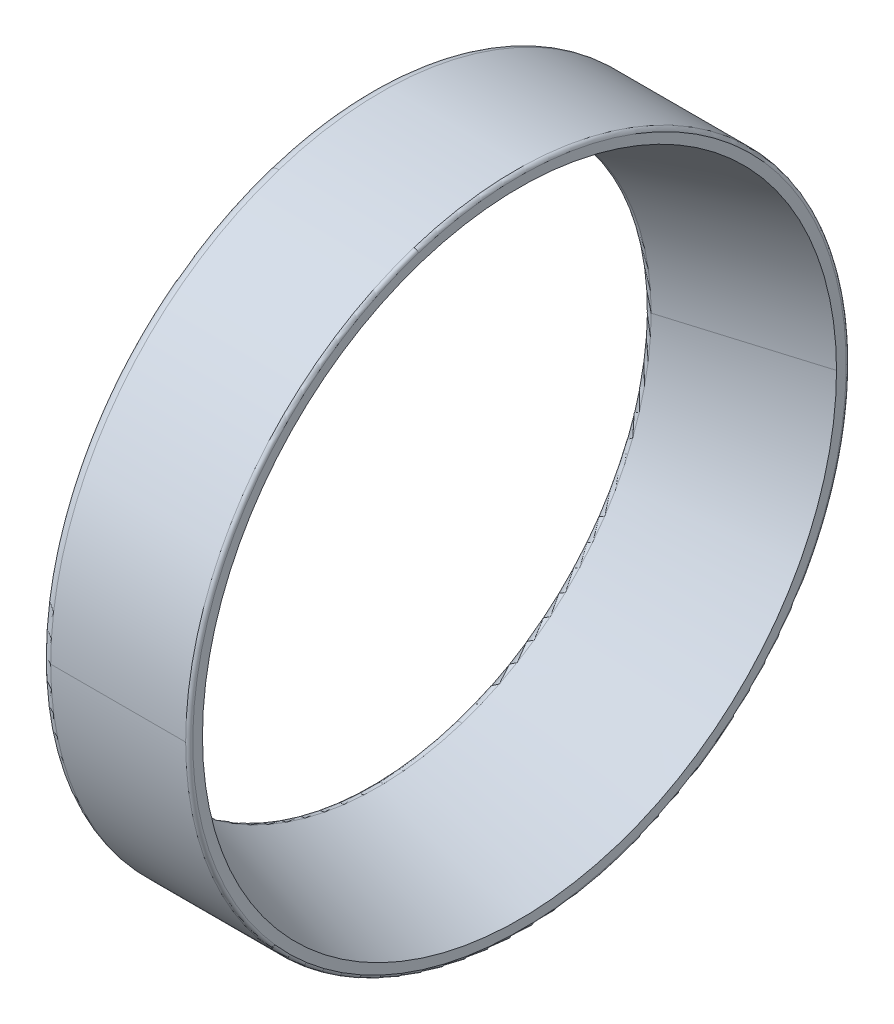
ISO-10303-21;
HEADER;
FILE_DESCRIPTION(('STEP AP214'),'2;1');
FILE_NAME('part.step','',(''),(''),'','','');
FILE_SCHEMA(('AUTOMOTIVE_DESIGN { 1 0 10303 214 1 1 1 1 }'));
ENDSEC;
DATA;
#1=APPLICATION_CONTEXT('core data for automotive mechanical design processes');
#2=APPLICATION_PROTOCOL_DEFINITION('international standard','automotive_design',2000,#1);
#3=PRODUCT_CONTEXT('',#1,'mechanical');
#4=PRODUCT('Part','Part','',(#3));
#5=PRODUCT_RELATED_PRODUCT_CATEGORY('part','',(#4));
#6=PRODUCT_DEFINITION_FORMATION('','',#4);
#7=PRODUCT_DEFINITION_CONTEXT('part definition',#1,'design');
#8=PRODUCT_DEFINITION('design','',#6,#7);
#9=PRODUCT_DEFINITION_SHAPE('','',#8);
#10=(LENGTH_UNIT() NAMED_UNIT(*) SI_UNIT(.MILLI.,.METRE.));
#11=(NAMED_UNIT(*) PLANE_ANGLE_UNIT() SI_UNIT($,.RADIAN.));
#12=(NAMED_UNIT(*) SI_UNIT($,.STERADIAN.) SOLID_ANGLE_UNIT());
#13=UNCERTAINTY_MEASURE_WITH_UNIT(LENGTH_MEASURE(1.E-05),#10,'distance_accuracy_value','');
#14=(GEOMETRIC_REPRESENTATION_CONTEXT(3) GLOBAL_UNCERTAINTY_ASSIGNED_CONTEXT((#13)) GLOBAL_UNIT_ASSIGNED_CONTEXT((#10,
#11,#12)) REPRESENTATION_CONTEXT('',''));
#15=CARTESIAN_POINT('',(0.,0.,0.));
#16=DIRECTION('',(0.,0.,1.));
#17=DIRECTION('',(1.,0.,0.));
#18=AXIS2_PLACEMENT_3D('',#15,#16,#17);
#19=CARTESIAN_POINT('',(0.,30.,0.));
#20=DIRECTION('',(-1.,0.,0.));
#21=DIRECTION('',(0.,0.,1.));
#22=AXIS2_PLACEMENT_3D('',#19,#20,#21);
#23=PLANE('',#22);
#24=CARTESIAN_POINT('',(0.,0.,0.));
#25=DIRECTION('',(1.,0.,0.));
#26=DIRECTION('',(0.,0.,-1.));
#27=AXIS2_PLACEMENT_3D('',#24,#25,#26);
#28=CIRCLE('',#27,26.194506589319);
#29=CARTESIAN_POINT('',(0.,24.912456182909,8.09454769536639));
#30=VERTEX_POINT('',#29);
#31=CARTESIAN_POINT('',(0.,-24.912456182909,-8.09454769536639));
#32=VERTEX_POINT('',#31);
#33=EDGE_CURVE('E11',#30,#32,#28,.T.);
#34=ORIENTED_EDGE('',*,*,#33,.T.);
#35=CARTESIAN_POINT('',(0.,-24.9124561829082,-8.09454769536611));
#36=CARTESIAN_POINT('',(0.,-23.6409159612502,-12.0077505466506));
#37=CARTESIAN_POINT('',(0.,-21.6013366229047,-15.671524375809));
#38=CARTESIAN_POINT('',(0.,-18.8576845788042,-18.8837550591196));
#39=CARTESIAN_POINT('',(0.,-12.258765956361,-24.0591736714021));
#40=CARTESIAN_POINT('',(0.,-4.19301205613674,-26.3558026739899));
#41=CARTESIAN_POINT('',(0.,0.0184356202171561,-26.687257975938));
#42=CARTESIAN_POINT('',(0.,8.34414661446186,-25.680642667106));
#43=CARTESIAN_POINT('',(0.,15.6714619323235,-21.6012814214827));
#44=CARTESIAN_POINT('',(0.,18.8837701351354,-18.8577016143688));
#45=CARTESIAN_POINT('',(0.,24.0591774551547,-12.2587585303285));
#46=CARTESIAN_POINT('',(0.,26.3557800304688,-4.19300987263736));
#47=CARTESIAN_POINT('',(0.,26.6873393381866,0.0184175489580376));
#48=CARTESIAN_POINT('',(0.,26.1838814597694,4.18130749625321));
#49=CARTESIAN_POINT('',(0.,24.9124561829082,8.0945476953661));
#50=B_SPLINE_CURVE_WITH_KNOTS('',5,(#35,#36,#37,#38,#39,#40,#41,#42,#43,#44,#45,#46,#47,#48,
#49),.UNSPECIFIED.,.F.,.F.,(6,3,3,3,6),(0.,0.785398163397448,1.5707963267949,2.35619449019234,
3.14159265358979),.UNSPECIFIED.);
#51=EDGE_CURVE('E26',#32,#30,#50,.T.);
#52=ORIENTED_EDGE('',*,*,#51,.T.);
#53=EDGE_LOOP('',(#34,#52));
#54=FACE_BOUND('',#53,.T.);
#55=CARTESIAN_POINT('',(0.,28.5316954888554,9.27050983124875));
#56=CARTESIAN_POINT('',(0.,28.3800168763054,9.73736229612138));
#57=CARTESIAN_POINT('',(0.,28.2168608911882,10.200484604974));
#58=CARTESIAN_POINT('',(0.,27.8680300185108,11.1181694718517));
#59=CARTESIAN_POINT('',(0.,27.6823551309506,11.5727320298769));
#60=CARTESIAN_POINT('',(0.,27.2889222960789,12.4721979563124));
#61=CARTESIAN_POINT('',(0.,27.0811643487674,12.9171013247227));
#62=CARTESIAN_POINT('',(0.,26.6440689733558,13.7961782284062));
#63=CARTESIAN_POINT('',(0.,26.4147315452556,14.2303517636793));
#64=CARTESIAN_POINT('',(0.,25.9350288791135,15.0869227261389));
#65=CARTESIAN_POINT('',(0.,25.6846636410715,15.5093201533254));
#66=CARTESIAN_POINT('',(0.,25.1635087273838,16.3413213910462));
#67=CARTESIAN_POINT('',(0.,24.8927190517382,16.7509252015806));
#68=CARTESIAN_POINT('',(0.,24.3313675597939,17.5563524120772));
#69=CARTESIAN_POINT('',(0.,24.0408057434953,17.9521758120395));
#70=CARTESIAN_POINT('',(0.,23.4406099749455,18.7290886341706));
#71=CARTESIAN_POINT('',(0.,23.1309760226944,19.1101780563393));
#72=CARTESIAN_POINT('',(0.,22.4933819133085,19.8567048434729));
#73=CARTESIAN_POINT('',(0.,22.1654217561738,20.2221422084378));
#74=CARTESIAN_POINT('',(0.,21.4919653229018,20.936484510975));
#75=CARTESIAN_POINT('',(0.,21.1464690467647,21.2853894485474));
#76=CARTESIAN_POINT('',(0.,20.4387727059745,21.9658263536289));
#77=CARTESIAN_POINT('',(0.,20.0765726413215,22.297358321138));
#78=CARTESIAN_POINT('',(0.,19.3363412952619,22.9422505965754));
#79=CARTESIAN_POINT('',(0.,18.9583100138554,23.2556109045037));
#80=CARTESIAN_POINT('',(0.,18.1873269447355,23.8634049483423));
#81=CARTESIAN_POINT('',(0.,17.7943751570221,24.1578386842526));
#82=CARTESIAN_POINT('',(0.,16.9944977305695,24.7270702673982));
#83=CARTESIAN_POINT('',(0.,16.5875720918303,25.0018681146335));
#84=CARTESIAN_POINT('',(0.,15.7607272828305,25.5311659083451));
#85=CARTESIAN_POINT('',(0.,15.34080811257,25.7856658548215));
#86=CARTESIAN_POINT('',(0.,14.4889878625899,26.2737547343526));
#87=CARTESIAN_POINT('',(0.,14.0570867828703,26.5073436674075));
#88=CARTESIAN_POINT('',(0.,13.1823432015031,26.953047783896));
#89=CARTESIAN_POINT('',(0.,12.7395006998554,27.1651629673297));
#90=CARTESIAN_POINT('',(0.,11.8439411210069,27.5674085805199));
#91=CARTESIAN_POINT('',(0.,11.391224043806,27.7575390102763));
#92=CARTESIAN_POINT('',(0.,10.4770059489434,28.1153570752534));
#93=CARTESIAN_POINT('',(0.,10.0155049312817,28.283044710474));
#94=CARTESIAN_POINT('',(0.,9.08483075187166,28.5955732121782));
#95=CARTESIAN_POINT('',(0.,8.61565759012334,28.7404140786619));
#96=CARTESIAN_POINT('',(0.,7.67076940178144,29.0069001085585));
#97=CARTESIAN_POINT('',(0.,7.19505437518788,29.1285452719714));
#98=CARTESIAN_POINT('',(0.,6.23822849632228,29.3483468418729));
#99=CARTESIAN_POINT('',(0.,5.75711764405025,29.4465032483615));
#100=CARTESIAN_POINT('',(0.,4.79065915201119,29.6190908370336));
#101=CARTESIAN_POINT('',(0.,4.30531151224416,29.6935220192172));
#102=CARTESIAN_POINT('',(0.,3.33154869019073,29.818479848042));
#103=CARTESIAN_POINT('',(0.,2.84313350790433,29.8690064946832));
#104=CARTESIAN_POINT('',(0.,1.86441223576639,29.9460335293061));
#105=CARTESIAN_POINT('',(0.,1.37410614591486,29.9725339172876));
#106=CARTESIAN_POINT('',(0.,0.392784248962867,30.0014445928353));
#107=CARTESIAN_POINT('',(0.,-0.0982315581375948,30.0038548804013));
#108=CARTESIAN_POINT('',(0.,-1.07978998950024,29.9845795485241));
#109=CARTESIAN_POINT('',(0.,-1.57033261376242,29.9628939290809));
#110=CARTESIAN_POINT('',(0.,-2.54976291930021,29.8954790257417));
#111=CARTESIAN_POINT('',(0.,-3.03865060057581,29.8497497418457));
#112=CARTESIAN_POINT('',(0.,-4.01359324689474,29.7343576754515));
#113=CARTESIAN_POINT('',(0.,-4.49964821193806,29.6646948929531));
#114=CARTESIAN_POINT('',(0.,-5.46775447680824,29.5016036530989));
#115=CARTESIAN_POINT('',(0.,-5.94980577663511,29.4081751957431));
#116=CARTESIAN_POINT('',(0.,-6.90874340726839,29.1977776835108));
#117=CARTESIAN_POINT('',(0.,-7.38562973807481,29.0808086286345));
#118=CARTESIAN_POINT('',(0.,-8.33308856972597,28.8236117100599));
#119=CARTESIAN_POINT('',(0.,-8.80366107057071,28.6833838463616));
#120=CARTESIAN_POINT('',(0.,-9.73735859192672,28.3800071313491));
#121=CARTESIAN_POINT('',(0.,-10.200483612438,28.216858280035));
#122=CARTESIAN_POINT('',(0.,-11.1181704643876,27.868032629664));
#123=CARTESIAN_POINT('',(0.,-11.572732295826,27.682355830607));
#124=CARTESIAN_POINT('',(0.,-12.4721976903631,27.2889215964226));
#125=CARTESIAN_POINT('',(0.,-12.9171012534618,27.0811641612951));
#126=CARTESIAN_POINT('',(0.,-13.7961782996671,26.6440691608282));
#127=CARTESIAN_POINT('',(0.,-14.2303517827736,26.4147315954887));
#128=CARTESIAN_POINT('',(0.,-15.0869227070446,25.9350288288805));
#129=CARTESIAN_POINT('',(0.,-15.509320148209,25.6846636276116));
#130=CARTESIAN_POINT('',(0.,-16.3413213961625,25.1635087408438));
#131=CARTESIAN_POINT('',(0.,-16.7509252029514,24.8927190553448));
#132=CARTESIAN_POINT('',(0.,-17.5563524107063,24.3313675561873));
#133=CARTESIAN_POINT('',(0.,-17.9521758116722,24.0408057425289));
#134=CARTESIAN_POINT('',(0.,-18.7290886345379,23.4406099759119));
#135=CARTESIAN_POINT('',(0.,-19.1101780564377,23.1309760229534));
#136=CARTESIAN_POINT('',(0.,-19.8567048433744,22.4933819130496));
#137=CARTESIAN_POINT('',(0.,-20.2221422084113,22.1654217561044));
#138=CARTESIAN_POINT('',(0.,-20.9364845110014,21.4919653229712));
#139=CARTESIAN_POINT('',(0.,-21.2853894485545,21.1464690467833));
#140=CARTESIAN_POINT('',(0.,-21.9658263536219,20.4387727059559));
#141=CARTESIAN_POINT('',(0.,-22.2973583211361,20.0765726413165));
#142=CARTESIAN_POINT('',(0.,-22.9422505965773,19.3363412952669));
#143=CARTESIAN_POINT('',(0.,-23.2556109045042,18.9583100138568));
#144=CARTESIAN_POINT('',(0.,-23.8634049483418,18.1873269447342));
#145=CARTESIAN_POINT('',(0.,-24.1578386842524,17.7943751570218));
#146=CARTESIAN_POINT('',(0.,-24.7270702673983,16.9944977305699));
#147=CARTESIAN_POINT('',(0.,-25.0018681146335,16.5875720918304));
#148=CARTESIAN_POINT('',(0.,-25.5311659083451,15.7607272828304));
#149=CARTESIAN_POINT('',(0.,-25.7856658548214,15.34080811257));
#150=CARTESIAN_POINT('',(0.,-26.2737547343526,14.48898786259));
#151=CARTESIAN_POINT('',(0.,-26.5073436674075,14.0570867828704));
#152=CARTESIAN_POINT('',(0.,-26.953047783896,13.1823432015031));
#153=CARTESIAN_POINT('',(0.,-27.1651629673297,12.7395006998554));
#154=CARTESIAN_POINT('',(0.,-27.5674085805199,11.8439411210069));
#155=CARTESIAN_POINT('',(0.,-27.7575390102764,11.391224043806));
#156=CARTESIAN_POINT('',(0.,-28.1153570752533,10.4770059489435));
#157=CARTESIAN_POINT('',(0.,-28.2830447104736,10.0155049312818));
#158=CARTESIAN_POINT('',(0.,-28.5955732121786,9.08483075187159));
#159=CARTESIAN_POINT('',(0.,-28.7404140786633,8.61565759012299));
#160=CARTESIAN_POINT('',(0.,-29.0069001085571,7.67076940178185));
#161=CARTESIAN_POINT('',(0.,-29.1285452719663,7.1950543751893));
#162=CARTESIAN_POINT('',(0.,-29.348346841878,6.23822849632092));
#163=CARTESIAN_POINT('',(0.,-29.4465032483807,5.75711764404508));
#164=CARTESIAN_POINT('',(0.,-29.6190908370144,4.79065915201643));
#165=CARTESIAN_POINT('',(0.,-29.6935220191455,4.30531151226363));
#166=CARTESIAN_POINT('',(0.,-29.8184798481136,3.3315486901713));
#167=CARTESIAN_POINT('',(0.,-29.8690064949506,2.84313350783177));
#168=CARTESIAN_POINT('',(0.,-29.9460335290387,1.86441223583899));
#169=CARTESIAN_POINT('',(0.,-29.9725339162899,1.37410614618573));
#170=CARTESIAN_POINT('',(0.,-30.001444593833,0.392784248692052));
#171=CARTESIAN_POINT('',(0.,-30.0038548841249,-0.0982315591483668));
#172=CARTESIAN_POINT('',(0.,-29.9845795448006,-1.07978998848941));
#173=CARTESIAN_POINT('',(0.,-29.9628939151843,-1.57033260999003));
#174=CARTESIAN_POINT('',(0.,-29.8954790396382,-2.54976292307255));
#175=CARTESIAN_POINT('',(0.,-29.8497497937085,-3.03865061465444));
#176=CARTESIAN_POINT('',(0.,-29.7343576235887,-4.01359323281607));
#177=CARTESIAN_POINT('',(0.,-29.6646946993987,-4.49964815939581));
#178=CARTESIAN_POINT('',(0.,-29.5016038466534,-5.46775452935045));
#179=CARTESIAN_POINT('',(0.,-29.408175918098,-5.94980597272536));
#180=CARTESIAN_POINT('',(0.,-29.1977769611559,-6.90874321117809));
#181=CARTESIAN_POINT('',(0.,-29.0808059327692,-7.38562900625592));
#182=CARTESIAN_POINT('',(0.,-28.8236144059252,-8.3330893015448));
#183=CARTESIAN_POINT('',(0.,-28.6833939074678,-8.80366380175586));
#184=CARTESIAN_POINT('',(0.,-28.5316954888554,-9.27050983124869));
#185=B_SPLINE_CURVE_WITH_KNOTS('',3,(#55,#56,#57,#58,#59,#60,#61,#62,#63,#64,#65,#66,#67,#68,
#69,#70,#71,#72,#73,#74,#75,#76,#77,#78,#79,#80,#81,#82,#83,#84,#85,#86,#87,#88,#89,#90,#91,#92,
#93,#94,#95,#96,#97,#98,#99,#100,#101,#102,#103,#104,#105,#106,#107,#108,#109,#110,#111,#112,
#113,#114,#115,#116,#117,#118,#119,#120,#121,#122,#123,#124,#125,#126,#127,#128,#129,#130,#131,
#132,#133,#134,#135,#136,#137,#138,#139,#140,#141,#142,#143,#144,#145,#146,#147,#148,#149,#150,
#151,#152,#153,#154,#155,#156,#157,#158,#159,#160,#161,#162,#163,#164,#165,#166,#167,#168,#169,
#170,#171,#172,#173,#174,#175,#176,#177,#178,#179,#180,#181,#182,#183,#184),.UNSPECIFIED.,.F.,
.F.,(4,2,2,2,2,2,2,2,2,2,2,2,2,2,2,2,2,2,2,2,2,2,2,2,2,2,2,2,2,2,2,2,2,2,2,2,2,2,2,2,2,2,2,2,2,
2,2,2,2,2,2,2,2,2,2,2,2,2,2,2,2,2,2,2,4),(0.,1.47247371137477,2.94494742274955,4.41742113412433,
5.88989484549911,7.36236855687388,8.83484226824866,10.3073159796234,11.7797896909982,
13.252263402373,14.7247371137478,16.1972108251225,17.6696845364973,19.1421582478721,
20.6146319592469,22.0871056706216,23.5595793819964,25.0320530933712,26.504526804746,
27.9770005161207,29.4494742274955,30.9219479388703,32.3944216502451,33.8668953616198,
35.3393690729946,36.8118427843694,38.2843164957442,39.7567902071189,41.2292639184937,
42.7017376298685,44.1742113412433,45.6466850526181,47.1191587639928,48.5916324753676,
50.0641061867424,51.5365798981172,53.0090536094919,54.4815273208667,55.9540010322415,
57.4264747436163,58.8989484549911,60.3714221663658,61.8438958777406,63.3163695891154,
64.7888433004902,66.2613170118649,67.7337907232397,69.2062644346145,70.6787381459892,
72.151211857364,73.6236855687388,75.0961592801136,76.5686329914883,78.0411067028631,
79.5135804142379,80.9860541256127,82.4585278369874,83.9310015483622,85.403475259737,
86.8759489711117,88.3484226824865,89.8208963938613,91.2933701052361,92.7658438166108,
94.2383175279856),.UNSPECIFIED.);
#186=CARTESIAN_POINT('',(0.,28.5316954888554,9.27050983124867));
#187=VERTEX_POINT('',#186);
#188=CARTESIAN_POINT('',(0.,-28.5316954888554,-9.27050983124866));
#189=VERTEX_POINT('',#188);
#190=EDGE_CURVE('E200',#187,#189,#185,.T.);
#191=ORIENTED_EDGE('',*,*,#190,.F.);
#192=CARTESIAN_POINT('',(0.,-28.5316954888554,-9.27050983124874));
#193=CARTESIAN_POINT('',(0.,-28.3800168763054,-9.73736229612138));
#194=CARTESIAN_POINT('',(0.,-28.2168608911882,-10.200484604974));
#195=CARTESIAN_POINT('',(0.,-27.8680300185108,-11.1181694718517));
#196=CARTESIAN_POINT('',(0.,-27.6823551309506,-11.5727320298769));
#197=CARTESIAN_POINT('',(0.,-27.2889222960789,-12.4721979563124));
#198=CARTESIAN_POINT('',(0.,-27.0811643487674,-12.9171013247227));
#199=CARTESIAN_POINT('',(0.,-26.6440689733558,-13.7961782284062));
#200=CARTESIAN_POINT('',(0.,-26.4147315452556,-14.2303517636793));
#201=CARTESIAN_POINT('',(0.,-25.9350288791135,-15.0869227261389));
#202=CARTESIAN_POINT('',(0.,-25.6846636410715,-15.5093201533253));
#203=CARTESIAN_POINT('',(0.,-25.1635087273838,-16.3413213910462));
#204=CARTESIAN_POINT('',(0.,-24.8927190517382,-16.7509252015805));
#205=CARTESIAN_POINT('',(0.,-24.3313675597939,-17.5563524120772));
#206=CARTESIAN_POINT('',(0.,-24.0408057434953,-17.9521758120395));
#207=CARTESIAN_POINT('',(0.,-23.4406099749455,-18.7290886341705));
#208=CARTESIAN_POINT('',(0.,-23.1309760226944,-19.1101780563393));
#209=CARTESIAN_POINT('',(0.,-22.4933819133086,-19.8567048434729));
#210=CARTESIAN_POINT('',(0.,-22.1654217561738,-20.2221422084377));
#211=CARTESIAN_POINT('',(0.,-21.4919653229018,-20.936484510975));
#212=CARTESIAN_POINT('',(0.,-21.1464690467647,-21.2853894485474));
#213=CARTESIAN_POINT('',(0.,-20.4387727059745,-21.9658263536289));
#214=CARTESIAN_POINT('',(0.,-20.0765726413215,-22.297358321138));
#215=CARTESIAN_POINT('',(0.,-19.336341295262,-22.9422505965754));
#216=CARTESIAN_POINT('',(0.,-18.9583100138554,-23.2556109045037));
#217=CARTESIAN_POINT('',(0.,-18.1873269447355,-23.8634049483423));
#218=CARTESIAN_POINT('',(0.,-17.7943751570222,-24.1578386842526));
#219=CARTESIAN_POINT('',(0.,-16.9944977305695,-24.7270702673981));
#220=CARTESIAN_POINT('',(0.,-16.5875720918303,-25.0018681146335));
#221=CARTESIAN_POINT('',(0.,-15.7607272828305,-25.5311659083451));
#222=CARTESIAN_POINT('',(0.,-15.34080811257,-25.7856658548214));
#223=CARTESIAN_POINT('',(0.,-14.48898786259,-26.2737547343526));
#224=CARTESIAN_POINT('',(0.,-14.0570867828704,-26.5073436674075));
#225=CARTESIAN_POINT('',(0.,-13.1823432015031,-26.953047783896));
#226=CARTESIAN_POINT('',(0.,-12.7395006998554,-27.1651629673297));
#227=CARTESIAN_POINT('',(0.,-11.8439411210069,-27.5674085805198));
#228=CARTESIAN_POINT('',(0.,-11.391224043806,-27.7575390102763));
#229=CARTESIAN_POINT('',(0.,-10.4770059489435,-28.1153570752534));
#230=CARTESIAN_POINT('',(0.,-10.0155049312817,-28.283044710474));
#231=CARTESIAN_POINT('',(0.,-9.0848307518717,-28.5955732121782));
#232=CARTESIAN_POINT('',(0.,-8.61565759012337,-28.7404140786619));
#233=CARTESIAN_POINT('',(0.,-7.67076940178148,-29.0069001085585));
#234=CARTESIAN_POINT('',(0.,-7.19505437518791,-29.1285452719714));
#235=CARTESIAN_POINT('',(0.,-6.23822849632232,-29.3483468418729));
#236=CARTESIAN_POINT('',(0.,-5.75711764405029,-29.4465032483615));
#237=CARTESIAN_POINT('',(0.,-4.79065915201123,-29.6190908370336));
#238=CARTESIAN_POINT('',(0.,-4.3053115122442,-29.6935220192172));
#239=CARTESIAN_POINT('',(0.,-3.33154869019077,-29.818479848042));
#240=CARTESIAN_POINT('',(0.,-2.84313350790437,-29.8690064946832));
#241=CARTESIAN_POINT('',(0.,-1.86441223576643,-29.946033529306));
#242=CARTESIAN_POINT('',(0.,-1.3741061459149,-29.9725339172876));
#243=CARTESIAN_POINT('',(0.,-0.392784248962901,-30.0014445928353));
#244=CARTESIAN_POINT('',(0.,0.0982315581375557,-30.0038548804013));
#245=CARTESIAN_POINT('',(0.,1.0797899895002,-29.9845795485241));
#246=CARTESIAN_POINT('',(0.,1.57033261376238,-29.9628939290809));
#247=CARTESIAN_POINT('',(0.,2.54976291930016,-29.8954790257417));
#248=CARTESIAN_POINT('',(0.,3.03865060057576,-29.8497497418457));
#249=CARTESIAN_POINT('',(0.,4.01359324689468,-29.7343576754515));
#250=CARTESIAN_POINT('',(0.,4.499648211938,-29.6646948929532));
#251=CARTESIAN_POINT('',(0.,5.46775447680819,-29.501603653099));
#252=CARTESIAN_POINT('',(0.,5.94980577663505,-29.4081751957431));
#253=CARTESIAN_POINT('',(0.,6.90874340726833,-29.1977776835108));
#254=CARTESIAN_POINT('',(0.,7.38562973807475,-29.0808086286345));
#255=CARTESIAN_POINT('',(0.,8.33308856972591,-28.8236117100599));
#256=CARTESIAN_POINT('',(0.,8.80366107057066,-28.6833838463616));
#257=CARTESIAN_POINT('',(0.,9.73735859192667,-28.3800071313492));
#258=CARTESIAN_POINT('',(0.,10.2004836124379,-28.2168582800351));
#259=CARTESIAN_POINT('',(0.,11.1181704643876,-27.868032629664));
#260=CARTESIAN_POINT('',(0.,11.572732295826,-27.682355830607));
#261=CARTESIAN_POINT('',(0.,12.4721976903631,-27.2889215964226));
#262=CARTESIAN_POINT('',(0.,12.9171012534618,-27.0811641612951));
#263=CARTESIAN_POINT('',(0.,13.796178299667,-26.6440691608282));
#264=CARTESIAN_POINT('',(0.,14.2303517827735,-26.4147315954887));
#265=CARTESIAN_POINT('',(0.,15.0869227070445,-25.9350288288805));
#266=CARTESIAN_POINT('',(0.,15.509320148209,-25.6846636276117));
#267=CARTESIAN_POINT('',(0.,16.3413213961624,-25.1635087408438));
#268=CARTESIAN_POINT('',(0.,16.7509252029514,-24.8927190553448));
#269=CARTESIAN_POINT('',(0.,17.5563524107062,-24.3313675561874));
#270=CARTESIAN_POINT('',(0.,17.9521758116721,-24.0408057425289));
#271=CARTESIAN_POINT('',(0.,18.7290886345378,-23.440609975912));
#272=CARTESIAN_POINT('',(0.,19.1101780564376,-23.1309760229534));
#273=CARTESIAN_POINT('',(0.,19.8567048433744,-22.4933819130497));
#274=CARTESIAN_POINT('',(0.,20.2221422084113,-22.1654217561044));
#275=CARTESIAN_POINT('',(0.,20.9364845110013,-21.4919653229713));
#276=CARTESIAN_POINT('',(0.,21.2853894485544,-21.1464690467833));
#277=CARTESIAN_POINT('',(0.,21.9658263536218,-20.438772705956));
#278=CARTESIAN_POINT('',(0.,22.2973583211361,-20.0765726413166));
#279=CARTESIAN_POINT('',(0.,22.9422505965773,-19.336341295267));
#280=CARTESIAN_POINT('',(0.,23.2556109045042,-18.9583100138568));
#281=CARTESIAN_POINT('',(0.,23.8634049483417,-18.1873269447343));
#282=CARTESIAN_POINT('',(0.,24.1578386842524,-17.7943751570219));
#283=CARTESIAN_POINT('',(0.,24.7270702673982,-16.99449773057));
#284=CARTESIAN_POINT('',(0.,25.0018681146335,-16.5875720918305));
#285=CARTESIAN_POINT('',(0.,25.531165908345,-15.7607272828305));
#286=CARTESIAN_POINT('',(0.,25.7856658548214,-15.3408081125701));
#287=CARTESIAN_POINT('',(0.,26.2737547343526,-14.4889878625901));
#288=CARTESIAN_POINT('',(0.,26.5073436674075,-14.0570867828705));
#289=CARTESIAN_POINT('',(0.,26.953047783896,-13.1823432015032));
#290=CARTESIAN_POINT('',(0.,27.1651629673296,-12.7395006998555));
#291=CARTESIAN_POINT('',(0.,27.5674085805198,-11.843941121007));
#292=CARTESIAN_POINT('',(0.,27.7575390102764,-11.3912240438061));
#293=CARTESIAN_POINT('',(0.,28.1153570752533,-10.4770059489436));
#294=CARTESIAN_POINT('',(0.,28.2830447104736,-10.0155049312819));
#295=CARTESIAN_POINT('',(0.,28.5955732121786,-9.08483075187167));
#296=CARTESIAN_POINT('',(0.,28.7404140786633,-8.61565759012307));
#297=CARTESIAN_POINT('',(0.,29.0069001085571,-7.67076940178193));
#298=CARTESIAN_POINT('',(0.,29.1285452719662,-7.19505437518938));
#299=CARTESIAN_POINT('',(0.,29.348346841878,-6.238228496321));
#300=CARTESIAN_POINT('',(0.,29.4465032483806,-5.75711764404516));
#301=CARTESIAN_POINT('',(0.,29.6190908370144,-4.79065915201652));
#302=CARTESIAN_POINT('',(0.,29.6935220191455,-4.30531151226373));
#303=CARTESIAN_POINT('',(0.,29.8184798481136,-3.33154869017141));
#304=CARTESIAN_POINT('',(0.,29.8690064949506,-2.84313350783188));
#305=CARTESIAN_POINT('',(0.,29.9460335290387,-1.8644122358391));
#306=CARTESIAN_POINT('',(0.,29.9725339162899,-1.37410614618584));
#307=CARTESIAN_POINT('',(0.,30.001444593833,-0.392784248692162));
#308=CARTESIAN_POINT('',(0.,30.0038548841249,0.0982315591482563));
#309=CARTESIAN_POINT('',(0.,29.9845795448006,1.0797899884893));
#310=CARTESIAN_POINT('',(0.,29.9628939151843,1.57033260998992));
#311=CARTESIAN_POINT('',(0.,29.8954790396382,2.54976292307244));
#312=CARTESIAN_POINT('',(0.,29.8497497937085,3.03865061465433));
#313=CARTESIAN_POINT('',(0.,29.7343576235887,4.01359323281597));
#314=CARTESIAN_POINT('',(0.,29.6646946993987,4.4996481593957));
#315=CARTESIAN_POINT('',(0.,29.5016038466534,5.46775452935035));
#316=CARTESIAN_POINT('',(0.,29.408175918098,5.94980597272525));
#317=CARTESIAN_POINT('',(0.,29.1977769611559,6.90874321117798));
#318=CARTESIAN_POINT('',(0.,29.0808059327692,7.38562900625581));
#319=CARTESIAN_POINT('',(0.,28.8236144059252,8.33308930154469));
#320=CARTESIAN_POINT('',(0.,28.6833939074678,8.80366380175575));
#321=CARTESIAN_POINT('',(0.,28.5316954888554,9.27050983124858));
#322=B_SPLINE_CURVE_WITH_KNOTS('',3,(#192,#193,#194,#195,#196,#197,#198,#199,#200,#201,#202,
#203,#204,#205,#206,#207,#208,#209,#210,#211,#212,#213,#214,#215,#216,#217,#218,#219,#220,#221,
#222,#223,#224,#225,#226,#227,#228,#229,#230,#231,#232,#233,#234,#235,#236,#237,#238,#239,#240,
#241,#242,#243,#244,#245,#246,#247,#248,#249,#250,#251,#252,#253,#254,#255,#256,#257,#258,#259,
#260,#261,#262,#263,#264,#265,#266,#267,#268,#269,#270,#271,#272,#273,#274,#275,#276,#277,#278,
#279,#280,#281,#282,#283,#284,#285,#286,#287,#288,#289,#290,#291,#292,#293,#294,#295,#296,#297,
#298,#299,#300,#301,#302,#303,#304,#305,#306,#307,#308,#309,#310,#311,#312,#313,#314,#315,#316,
#317,#318,#319,#320,#321),.UNSPECIFIED.,.F.,.F.,(4,2,2,2,2,2,2,2,2,2,2,2,2,2,2,2,2,2,2,2,2,2,2,
2,2,2,2,2,2,2,2,2,2,2,2,2,2,2,2,2,2,2,2,2,2,2,2,2,2,2,2,2,2,2,2,2,2,2,2,2,2,2,2,2,4),(0.,
1.47247371137477,2.94494742274955,4.41742113412432,5.8898948454991,7.36236855687387,
8.83484226824864,10.3073159796234,11.7797896909982,13.252263402373,14.7247371137477,
16.1972108251225,17.6696845364973,19.1421582478721,20.6146319592468,22.0871056706216,
23.5595793819964,25.0320530933712,26.5045268047459,27.9770005161207,29.4494742274955,
30.9219479388703,32.394421650245,33.8668953616198,35.3393690729946,36.8118427843694,
38.2843164957441,39.7567902071189,41.2292639184937,42.7017376298684,44.1742113412432,
45.646685052618,47.1191587639928,48.5916324753676,50.0641061867423,51.5365798981171,
53.0090536094919,54.4815273208666,55.9540010322414,57.4264747436162,58.898948454991,
60.3714221663658,61.8438958777405,63.3163695891153,64.7888433004901,66.2613170118649,
67.7337907232396,69.2062644346144,70.6787381459892,72.151211857364,73.6236855687387,
75.0961592801135,76.5686329914883,78.041106702863,79.5135804142378,80.9860541256126,
82.4585278369873,83.9310015483621,85.4034752597369,86.8759489711117,88.3484226824865,
89.8208963938612,91.293370105236,92.7658438166108,94.2383175279855),.UNSPECIFIED.);
#323=EDGE_CURVE('E301',#189,#187,#322,.T.);
#324=ORIENTED_EDGE('',*,*,#323,.F.);
#325=EDGE_LOOP('',(#191,#324));
#326=FACE_BOUND('',#325,.T.);
#327=ADVANCED_FACE('F17',(#54,#326),#23,.T.);
#328=CARTESIAN_POINT('',(0.99999999999922,0.,0.));
#329=DIRECTION('',(1.,0.,0.));
#330=DIRECTION('',(0.,-0.309016994374947,0.951056516295154));
#331=AXIS2_PLACEMENT_3D('',#328,#329,#330);
#332=TOROIDAL_SURFACE('',#331,30.0000000000008,0.99999999999922);
#333=CARTESIAN_POINT('',(0.99999999999922,-28.5316954888554,-9.27050983124866));
#334=DIRECTION('',(0.,0.309016994374948,-0.951056516295153));
#335=DIRECTION('',(7.80153719404706E-13,-0.951056516295153,-0.309016994374948));
#336=AXIS2_PLACEMENT_3D('',#333,#334,#335);
#337=CIRCLE('',#336,0.99999999999922);
#338=CARTESIAN_POINT('',(1.,-29.4827520051498,-9.57952682562337));
#339=VERTEX_POINT('',#338);
#340=EDGE_CURVE('E264',#339,#189,#337,.T.);
#341=ORIENTED_EDGE('',*,*,#340,.T.);
#342=ORIENTED_EDGE('',*,*,#323,.T.);
#343=CARTESIAN_POINT('',(0.99999999999922,28.5316954888554,9.27050983124867));
#344=DIRECTION('',(0.,-0.309016994374948,0.951056516295153));
#345=DIRECTION('',(7.80153719404706E-13,0.951056516295153,0.309016994374948));
#346=AXIS2_PLACEMENT_3D('',#343,#344,#345);
#347=CIRCLE('',#346,0.99999999999922);
#348=CARTESIAN_POINT('',(1.,29.4827520051498,9.57952682562337));
#349=VERTEX_POINT('',#348);
#350=EDGE_CURVE('E260',#349,#187,#347,.T.);
#351=ORIENTED_EDGE('',*,*,#350,.F.);
#352=CARTESIAN_POINT('',(1.,0.,0.));
#353=DIRECTION('',(1.,0.,0.));
#354=DIRECTION('',(0.,0.,-1.));
#355=AXIS2_PLACEMENT_3D('',#352,#353,#354);
#356=CIRCLE('',#355,31.);
#357=CARTESIAN_POINT('',(1.,0.,-31.));
#358=VERTEX_POINT('',#357);
#359=EDGE_CURVE('E255',#358,#349,#356,.T.);
#360=ORIENTED_EDGE('',*,*,#359,.F.);
#361=CARTESIAN_POINT('',(1.,0.,0.));
#362=DIRECTION('',(1.,0.,0.));
#363=DIRECTION('',(0.,0.,-1.));
#364=AXIS2_PLACEMENT_3D('',#361,#362,#363);
#365=CIRCLE('',#364,31.);
#366=EDGE_CURVE('E250',#339,#358,#365,.T.);
#367=ORIENTED_EDGE('',*,*,#366,.F.);
#368=EDGE_LOOP('',(#341,#342,#351,#360,#367));
#369=FACE_BOUND('',#368,.T.);
#370=ADVANCED_FACE('F272',(#369),#332,.T.);
#371=CARTESIAN_POINT('',(14.,0.,0.));
#372=DIRECTION('',(1.,0.,0.));
#373=DIRECTION('',(0.,1.,0.));
#374=AXIS2_PLACEMENT_3D('',#371,#372,#373);
#375=CYLINDRICAL_SURFACE('',#374,31.);
#376=DIRECTION('',(1.,0.,0.));
#377=VECTOR('',#376,1.);
#378=CARTESIAN_POINT('',(1.,0.,31.));
#379=LINE('',#378,#377);
#380=CARTESIAN_POINT('',(1.,0.,31.));
#381=VERTEX_POINT('',#380);
#382=CARTESIAN_POINT('',(13.666666666667,0.,31.));
#383=VERTEX_POINT('',#382);
#384=EDGE_CURVE('E245',#381,#383,#379,.T.);
#385=ORIENTED_EDGE('',*,*,#384,.F.);
#386=CARTESIAN_POINT('',(1.,0.,0.));
#387=DIRECTION('',(1.,0.,0.));
#388=DIRECTION('',(0.,0.,-1.));
#389=AXIS2_PLACEMENT_3D('',#386,#387,#388);
#390=CIRCLE('',#389,31.);
#391=EDGE_CURVE('E240',#381,#339,#390,.T.);
#392=ORIENTED_EDGE('',*,*,#391,.T.);
#393=ORIENTED_EDGE('',*,*,#366,.T.);
#394=DIRECTION('',(1.,0.,0.));
#395=VECTOR('',#394,1.);
#396=CARTESIAN_POINT('',(1.,0.,-31.));
#397=LINE('',#396,#395);
#398=CARTESIAN_POINT('',(13.666666666667,0.,-31.));
#399=VERTEX_POINT('',#398);
#400=EDGE_CURVE('E236',#358,#399,#397,.T.);
#401=ORIENTED_EDGE('',*,*,#400,.T.);
#402=CARTESIAN_POINT('',(13.666666666667,0.,0.));
#403=DIRECTION('',(1.,0.,0.));
#404=DIRECTION('',(0.,0.,-1.));
#405=AXIS2_PLACEMENT_3D('',#402,#403,#404);
#406=CIRCLE('',#405,31.);
#407=CARTESIAN_POINT('',(13.666666666667,-29.4827520051498,-9.57952682562336));
#408=VERTEX_POINT('',#407);
#409=EDGE_CURVE('E231',#408,#399,#406,.T.);
#410=ORIENTED_EDGE('',*,*,#409,.F.);
#411=CARTESIAN_POINT('',(13.666666666667,0.,0.));
#412=DIRECTION('',(1.,0.,0.));
#413=DIRECTION('',(0.,0.,-1.));
#414=AXIS2_PLACEMENT_3D('',#411,#412,#413);
#415=CIRCLE('',#414,31.);
#416=EDGE_CURVE('E226',#383,#408,#415,.T.);
#417=ORIENTED_EDGE('',*,*,#416,.F.);
#418=EDGE_LOOP('',(#385,#392,#393,#401,#410,#417));
#419=FACE_BOUND('',#418,.T.);
#420=ADVANCED_FACE('F281',(#419),#375,.T.);
#421=CARTESIAN_POINT('',(13.666666666666,0.,0.));
#422=DIRECTION('',(1.,0.,0.));
#423=DIRECTION('',(0.,0.309016994374947,-0.951056516295154));
#424=AXIS2_PLACEMENT_3D('',#421,#422,#423);
#425=TOROIDAL_SURFACE('',#424,30.666666666666,0.333333333333954);
#426=CARTESIAN_POINT('',(13.666666666666,-29.1657331663841,-9.47652116083152));
#427=DIRECTION('',(0.,0.309016994374947,-0.951056516295154));
#428=DIRECTION('',(1.,0.,0.));
#429=AXIS2_PLACEMENT_3D('',#426,#427,#428);
#430=CIRCLE('',#429,0.333333333333954);
#431=CARTESIAN_POINT('',(14.,-29.1657331663841,-9.47652116083152));
#432=VERTEX_POINT('',#431);
#433=EDGE_CURVE('E222',#432,#408,#430,.T.);
#434=ORIENTED_EDGE('',*,*,#433,.F.);
#435=CARTESIAN_POINT('',(14.,0.,0.));
#436=DIRECTION('',(1.,0.,0.));
#437=DIRECTION('',(0.,0.,-1.));
#438=AXIS2_PLACEMENT_3D('',#435,#436,#437);
#439=CIRCLE('',#438,30.666666666667);
#440=CARTESIAN_POINT('',(14.,29.1657331663841,9.47652116083153));
#441=VERTEX_POINT('',#440);
#442=EDGE_CURVE('E218',#441,#432,#439,.T.);
#443=ORIENTED_EDGE('',*,*,#442,.F.);
#444=CARTESIAN_POINT('',(13.666666666666,29.1657331663841,9.47652116083153));
#445=DIRECTION('',(0.,-0.309016994374947,0.951056516295154));
#446=DIRECTION('',(1.,0.,0.));
#447=AXIS2_PLACEMENT_3D('',#444,#445,#446);
#448=CIRCLE('',#447,0.333333333333954);
#449=CARTESIAN_POINT('',(13.666666666667,29.4827520051498,9.57952682562337));
#450=VERTEX_POINT('',#449);
#451=EDGE_CURVE('E214',#441,#450,#448,.T.);
#452=ORIENTED_EDGE('',*,*,#451,.T.);
#453=CARTESIAN_POINT('',(13.666666666667,0.,0.));
#454=DIRECTION('',(1.,0.,0.));
#455=DIRECTION('',(0.,0.,-1.));
#456=AXIS2_PLACEMENT_3D('',#453,#454,#455);
#457=CIRCLE('',#456,31.);
#458=EDGE_CURVE('E209',#450,#383,#457,.T.);
#459=ORIENTED_EDGE('',*,*,#458,.T.);
#460=ORIENTED_EDGE('',*,*,#416,.T.);
#461=EDGE_LOOP('',(#434,#443,#452,#459,#460));
#462=FACE_BOUND('',#461,.T.);
#463=ADVANCED_FACE('F285',(#462),#425,.T.);
#464=CARTESIAN_POINT('',(14.,0.,0.));
#465=DIRECTION('',(1.,0.,0.));
#466=DIRECTION('',(0.,-1.,0.));
#467=AXIS2_PLACEMENT_3D('',#464,#465,#466);
#468=CYLINDRICAL_SURFACE('',#467,31.);
#469=ORIENTED_EDGE('',*,*,#384,.T.);
#470=ORIENTED_EDGE('',*,*,#458,.F.);
#471=CARTESIAN_POINT('',(13.666666666667,0.,0.));
#472=DIRECTION('',(1.,0.,0.));
#473=DIRECTION('',(0.,0.,-1.));
#474=AXIS2_PLACEMENT_3D('',#471,#472,#473);
#475=CIRCLE('',#474,31.);
#476=EDGE_CURVE('E204',#399,#450,#475,.T.);
#477=ORIENTED_EDGE('',*,*,#476,.F.);
#478=ORIENTED_EDGE('',*,*,#400,.F.);
#479=ORIENTED_EDGE('',*,*,#359,.T.);
#480=CARTESIAN_POINT('',(1.,0.,0.));
#481=DIRECTION('',(1.,0.,0.));
#482=DIRECTION('',(0.,0.,-1.));
#483=AXIS2_PLACEMENT_3D('',#480,#481,#482);
#484=CIRCLE('',#483,31.);
#485=EDGE_CURVE('E201',#349,#381,#484,.T.);
#486=ORIENTED_EDGE('',*,*,#485,.T.);
#487=EDGE_LOOP('',(#469,#470,#477,#478,#479,#486));
#488=FACE_BOUND('',#487,.T.);
#489=ADVANCED_FACE('F288',(#488),#468,.T.);
#490=CARTESIAN_POINT('',(0.99999999999922,0.,0.));
#491=DIRECTION('',(1.,0.,0.));
#492=DIRECTION('',(0.,0.309016994374947,-0.951056516295154));
#493=AXIS2_PLACEMENT_3D('',#490,#491,#492);
#494=TOROIDAL_SURFACE('',#493,30.0000000000008,0.99999999999922);
#495=ORIENTED_EDGE('',*,*,#340,.F.);
#496=ORIENTED_EDGE('',*,*,#391,.F.);
#497=ORIENTED_EDGE('',*,*,#485,.F.);
#498=ORIENTED_EDGE('',*,*,#350,.T.);
#499=ORIENTED_EDGE('',*,*,#190,.T.);
#500=EDGE_LOOP('',(#495,#496,#497,#498,#499));
#501=FACE_BOUND('',#500,.T.);
#502=ADVANCED_FACE('F170',(#501),#494,.T.);
#503=CARTESIAN_POINT('',(13.666666666666,0.,0.));
#504=DIRECTION('',(1.,0.,0.));
#505=DIRECTION('',(0.,-0.309016994374947,0.951056516295154));
#506=AXIS2_PLACEMENT_3D('',#503,#504,#505);
#507=TOROIDAL_SURFACE('',#506,30.666666666666,0.333333333333954);
#508=ORIENTED_EDGE('',*,*,#433,.T.);
#509=ORIENTED_EDGE('',*,*,#409,.T.);
#510=ORIENTED_EDGE('',*,*,#476,.T.);
#511=ORIENTED_EDGE('',*,*,#451,.F.);
#512=CARTESIAN_POINT('',(14.,-29.165733166385,-9.47652116083182));
#513=CARTESIAN_POINT('',(14.,-27.6771042434511,-14.0578209471131));
#514=CARTESIAN_POINT('',(14.,-25.2893097073722,-18.347106961253));
#515=CARTESIAN_POINT('',(14.,-22.0772368859639,-22.1077583514835));
#516=CARTESIAN_POINT('',(14.,-14.3516919490937,-28.1667706448492));
#517=CARTESIAN_POINT('',(14.,-4.90888051723387,-30.855500659259));
#518=CARTESIAN_POINT('',(14.,0.0215831139275327,-31.2435449701944));
#519=CARTESIAN_POINT('',(14.,9.76873383627085,-30.0650713069378));
#520=CARTESIAN_POINT('',(14.,18.347033856858,-25.2892450814703));
#521=CARTESIAN_POINT('',(14.,22.1077760014113,-22.0772568299921));
#522=CARTESIAN_POINT('',(14.,28.1667750745979,-14.3516832552225));
#523=CARTESIAN_POINT('',(14.,30.8554741498339,-4.90887796094794));
#524=CARTESIAN_POINT('',(14.,31.2436402233326,0.0215619573816763));
#525=CARTESIAN_POINT('',(14.,30.6542275201202,4.8951776503673));
#526=CARTESIAN_POINT('',(14.,29.165733166385,9.47652116083181));
#527=B_SPLINE_CURVE_WITH_KNOTS('',5,(#512,#513,#514,#515,#516,#517,#518,#519,#520,#521,#522,
#523,#524,#525,#526),.UNSPECIFIED.,.F.,.F.,(6,3,3,3,6),(0.,0.785398163397448,1.5707963267949,
2.35619449019234,3.14159265358979),.UNSPECIFIED.);
#528=EDGE_CURVE('E144',#432,#441,#527,.T.);
#529=ORIENTED_EDGE('',*,*,#528,.F.);
#530=EDGE_LOOP('',(#508,#509,#510,#511,#529));
#531=FACE_BOUND('',#530,.T.);
#532=ADVANCED_FACE('F164',(#531),#507,.T.);
#533=CARTESIAN_POINT('',(14.,29.756499982215,0.));
#534=DIRECTION('',(1.,0.,0.));
#535=DIRECTION('',(0.,0.,-1.));
#536=AXIS2_PLACEMENT_3D('',#533,#534,#535);
#537=PLANE('',#536);
#538=ORIENTED_EDGE('',*,*,#442,.T.);
#539=ORIENTED_EDGE('',*,*,#528,.T.);
#540=EDGE_LOOP('',(#538,#539));
#541=FACE_BOUND('',#540,.T.);
#542=CARTESIAN_POINT('',(14.,0.,0.));
#543=DIRECTION('',(1.,0.,0.));
#544=DIRECTION('',(0.,0.,-1.));
#545=AXIS2_PLACEMENT_3D('',#542,#543,#544);
#546=CIRCLE('',#545,29.756499982215);
#547=CARTESIAN_POINT('',(14.,0.,29.756499982215));
#548=VERTEX_POINT('',#547);
#549=CARTESIAN_POINT('',(14.,0.,-29.756499982215));
#550=VERTEX_POINT('',#549);
#551=EDGE_CURVE('E140',#548,#550,#546,.T.);
#552=ORIENTED_EDGE('',*,*,#551,.F.);
#553=CARTESIAN_POINT('',(14.,0.,0.));
#554=DIRECTION('',(1.,0.,0.));
#555=DIRECTION('',(0.,0.,-1.));
#556=AXIS2_PLACEMENT_3D('',#553,#554,#555);
#557=CIRCLE('',#556,29.756499982215);
#558=EDGE_CURVE('E135',#550,#548,#557,.T.);
#559=ORIENTED_EDGE('',*,*,#558,.F.);
#560=EDGE_LOOP('',(#552,#559));
#561=FACE_BOUND('',#560,.T.);
#562=ADVANCED_FACE('F153',(#541,#561),#537,.T.);
#563=CARTESIAN_POINT('',(0.644791562711199,0.,0.));
#564=DIRECTION('',(1.,0.,0.));
#565=DIRECTION('',(0.,-1.,0.));
#566=AXIS2_PLACEMENT_3D('',#563,#564,#565);
#567=CONICAL_SURFACE('',#566,25.715930155123,0.293791272988246);
#568=DIRECTION('',(0.957152868391757,0.,0.289583125422445));
#569=VECTOR('',#568,1.);
#570=CARTESIAN_POINT('',(0.644791562711185,0.,25.715930155123));
#571=LINE('',#570,#569);
#572=CARTESIAN_POINT('',(0.644791562711185,0.,25.715930155123));
#573=VERTEX_POINT('',#572);
#574=EDGE_CURVE('E131',#573,#548,#571,.T.);
#575=ORIENTED_EDGE('',*,*,#574,.F.);
#576=CARTESIAN_POINT('',(0.644791562711199,0.,0.));
#577=DIRECTION('',(1.,0.,0.));
#578=DIRECTION('',(0.,0.,-1.));
#579=AXIS2_PLACEMENT_3D('',#576,#577,#578);
#580=CIRCLE('',#579,25.715930155123);
#581=CARTESIAN_POINT('',(0.644791562711201,24.4573029466208,7.94665944409218));
#582=VERTEX_POINT('',#581);
#583=EDGE_CURVE('E114',#582,#573,#580,.T.);
#584=ORIENTED_EDGE('',*,*,#583,.F.);
#585=CARTESIAN_POINT('',(0.644791562711199,0.,0.));
#586=DIRECTION('',(1.,0.,0.));
#587=DIRECTION('',(0.,0.,-1.));
#588=AXIS2_PLACEMENT_3D('',#585,#586,#587);
#589=CIRCLE('',#588,25.715930155123);
#590=CARTESIAN_POINT('',(0.644791562711199,0.,-25.715930155123));
#591=VERTEX_POINT('',#590);
#592=EDGE_CURVE('E124',#591,#582,#589,.T.);
#593=ORIENTED_EDGE('',*,*,#592,.F.);
#594=DIRECTION('',(0.957152868391757,0.,-0.289583125422445));
#595=VECTOR('',#594,1.);
#596=CARTESIAN_POINT('',(0.644791562711185,0.,-25.715930155123));
#597=LINE('',#596,#595);
#598=EDGE_CURVE('E102',#591,#550,#597,.T.);
#599=ORIENTED_EDGE('',*,*,#598,.T.);
#600=ORIENTED_EDGE('',*,*,#558,.T.);
#601=EDGE_LOOP('',(#575,#584,#593,#599,#600));
#602=FACE_BOUND('',#601,.T.);
#603=ADVANCED_FACE('F163',(#602),#567,.F.);
#604=CARTESIAN_POINT('',(0.644791562711199,0.,0.));
#605=DIRECTION('',(1.,0.,0.));
#606=DIRECTION('',(0.,1.,0.));
#607=AXIS2_PLACEMENT_3D('',#604,#605,#606);
#608=CONICAL_SURFACE('',#607,25.715930155123,0.293791272988246);
#609=ORIENTED_EDGE('',*,*,#574,.T.);
#610=ORIENTED_EDGE('',*,*,#551,.T.);
#611=ORIENTED_EDGE('',*,*,#598,.F.);
#612=CARTESIAN_POINT('',(0.644791562711199,0.,0.));
#613=DIRECTION('',(1.,0.,0.));
#614=DIRECTION('',(0.,0.,-1.));
#615=AXIS2_PLACEMENT_3D('',#612,#613,#614);
#616=CIRCLE('',#615,25.715930155123);
#617=CARTESIAN_POINT('',(0.644791562711201,-24.4573029466208,-7.94665944409218));
#618=VERTEX_POINT('',#617);
#619=EDGE_CURVE('E93',#618,#591,#616,.T.);
#620=ORIENTED_EDGE('',*,*,#619,.F.);
#621=CARTESIAN_POINT('',(0.644791562711199,0.,0.));
#622=DIRECTION('',(1.,0.,0.));
#623=DIRECTION('',(0.,0.,-1.));
#624=AXIS2_PLACEMENT_3D('',#621,#622,#623);
#625=CIRCLE('',#624,25.715930155123);
#626=EDGE_CURVE('E98',#573,#618,#625,.T.);
#627=ORIENTED_EDGE('',*,*,#626,.F.);
#628=EDGE_LOOP('',(#609,#610,#611,#620,#627));
#629=FACE_BOUND('',#628,.T.);
#630=ADVANCED_FACE('F96',(#629),#608,.F.);
#631=CARTESIAN_POINT('',(0.500000000000757,0.,0.));
#632=DIRECTION('',(1.,0.,0.));
#633=DIRECTION('',(0.,0.309016994374947,-0.951056516295154));
#634=AXIS2_PLACEMENT_3D('',#631,#632,#633);
#635=TOROIDAL_SURFACE('',#634,26.1945065893199,0.500000000000757);
#636=CARTESIAN_POINT('',(0.500000000000757,-24.912456182909,-8.09454769536639));
#637=DIRECTION('',(0.,0.309016994374947,-0.951056516295154));
#638=DIRECTION('',(-1.,0.,0.));
#639=AXIS2_PLACEMENT_3D('',#636,#637,#638);
#640=CIRCLE('',#639,0.500000000000757);
#641=EDGE_CURVE('E106',#32,#618,#640,.T.);
#642=ORIENTED_EDGE('',*,*,#641,.F.);
#643=ORIENTED_EDGE('',*,*,#33,.F.);
#644=CARTESIAN_POINT('',(0.500000000000757,24.912456182909,8.09454769536639));
#645=DIRECTION('',(0.,-0.309016994374947,0.951056516295154));
#646=DIRECTION('',(-1.,0.,0.));
#647=AXIS2_PLACEMENT_3D('',#644,#645,#646);
#648=CIRCLE('',#647,0.500000000000757);
#649=EDGE_CURVE('E110',#30,#582,#648,.T.);
#650=ORIENTED_EDGE('',*,*,#649,.T.);
#651=ORIENTED_EDGE('',*,*,#583,.T.);
#652=ORIENTED_EDGE('',*,*,#626,.T.);
#653=EDGE_LOOP('',(#642,#643,#650,#651,#652));
#654=FACE_BOUND('',#653,.T.);
#655=ADVANCED_FACE('F112',(#654),#635,.T.);
#656=CARTESIAN_POINT('',(0.500000000000757,0.,0.));
#657=DIRECTION('',(1.,0.,0.));
#658=DIRECTION('',(0.,-0.309016994374947,0.951056516295154));
#659=AXIS2_PLACEMENT_3D('',#656,#657,#658);
#660=TOROIDAL_SURFACE('',#659,26.1945065893199,0.500000000000757);
#661=ORIENTED_EDGE('',*,*,#641,.T.);
#662=ORIENTED_EDGE('',*,*,#619,.T.);
#663=ORIENTED_EDGE('',*,*,#592,.T.);
#664=ORIENTED_EDGE('',*,*,#649,.F.);
#665=ORIENTED_EDGE('',*,*,#51,.F.);
#666=EDGE_LOOP('',(#661,#662,#663,#664,#665));
#667=FACE_BOUND('',#666,.T.);
#668=ADVANCED_FACE('F107',(#667),#660,.T.);
#669=CLOSED_SHELL('',(#327,#370,#420,#463,#489,#502,#532,#562,#603,#630,#655,#668));
#670=MANIFOLD_SOLID_BREP('B1',#669);
#671=ADVANCED_BREP_SHAPE_REPRESENTATION('',(#18,#670),#14);
#672=SHAPE_DEFINITION_REPRESENTATION(#9,#671);
ENDSEC;
END-ISO-10303-21;
